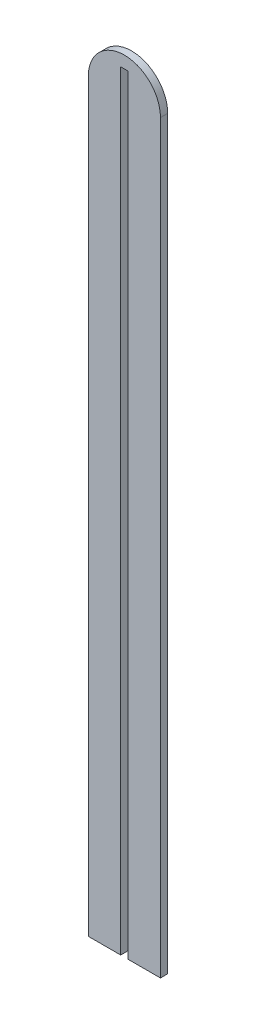
ISO-10303-21;
HEADER;
FILE_DESCRIPTION(('STEP AP214'),'2;1');
FILE_NAME('part.step','',(''),(''),'','','');
FILE_SCHEMA(('AUTOMOTIVE_DESIGN { 1 0 10303 214 1 1 1 1 }'));
ENDSEC;
DATA;
#1=APPLICATION_CONTEXT('core data for automotive mechanical design processes');
#2=APPLICATION_PROTOCOL_DEFINITION('international standard','automotive_design',2000,#1);
#3=PRODUCT_CONTEXT('',#1,'mechanical');
#4=PRODUCT('Part','Part','',(#3));
#5=PRODUCT_RELATED_PRODUCT_CATEGORY('part','',(#4));
#6=PRODUCT_DEFINITION_FORMATION('','',#4);
#7=PRODUCT_DEFINITION_CONTEXT('part definition',#1,'design');
#8=PRODUCT_DEFINITION('design','',#6,#7);
#9=PRODUCT_DEFINITION_SHAPE('','',#8);
#10=(LENGTH_UNIT() NAMED_UNIT(*) SI_UNIT(.MILLI.,.METRE.));
#11=(NAMED_UNIT(*) PLANE_ANGLE_UNIT() SI_UNIT($,.RADIAN.));
#12=(NAMED_UNIT(*) SI_UNIT($,.STERADIAN.) SOLID_ANGLE_UNIT());
#13=UNCERTAINTY_MEASURE_WITH_UNIT(LENGTH_MEASURE(1.E-05),#10,'distance_accuracy_value','');
#14=(GEOMETRIC_REPRESENTATION_CONTEXT(3) GLOBAL_UNCERTAINTY_ASSIGNED_CONTEXT((#13)) GLOBAL_UNIT_ASSIGNED_CONTEXT((#10,
#11,#12)) REPRESENTATION_CONTEXT('',''));
#15=CARTESIAN_POINT('',(0.,0.,0.));
#16=DIRECTION('',(0.,0.,1.));
#17=DIRECTION('',(1.,0.,0.));
#18=AXIS2_PLACEMENT_3D('',#15,#16,#17);
#19=CARTESIAN_POINT('',(14.9999999015433,0.,1.5));
#20=DIRECTION('',(1.,0.,0.));
#21=DIRECTION('',(0.,0.,-1.));
#22=AXIS2_PLACEMENT_3D('',#19,#20,#21);
#23=PLANE('',#22);
#24=DIRECTION('',(0.,-1.,0.));
#25=VECTOR('',#24,1.);
#26=CARTESIAN_POINT('',(14.9999999015433,0.,-1.5));
#27=LINE('',#26,#25);
#28=CARTESIAN_POINT('',(14.9999999015433,154.999998982614,-1.5));
#29=VERTEX_POINT('',#28);
#30=CARTESIAN_POINT('',(14.9999999015433,-155.000001017386,-1.5));
#31=VERTEX_POINT('',#30);
#32=EDGE_CURVE('E129',#29,#31,#27,.T.);
#33=ORIENTED_EDGE('',*,*,#32,.F.);
#34=DIRECTION('',(0.,0.,-1.));
#35=VECTOR('',#34,1.);
#36=CARTESIAN_POINT('',(14.9999999015433,154.999998982614,1.5));
#37=LINE('',#36,#35);
#38=CARTESIAN_POINT('',(14.9999999015433,154.999998982614,1.5));
#39=VERTEX_POINT('',#38);
#40=EDGE_CURVE('E11',#39,#29,#37,.T.);
#41=ORIENTED_EDGE('',*,*,#40,.F.);
#42=DIRECTION('',(0.,-1.,0.));
#43=VECTOR('',#42,1.);
#44=CARTESIAN_POINT('',(14.9999999015433,0.,1.5));
#45=LINE('',#44,#43);
#46=CARTESIAN_POINT('',(14.9999999015433,-155.000001017386,1.5));
#47=VERTEX_POINT('',#46);
#48=EDGE_CURVE('E176',#39,#47,#45,.T.);
#49=ORIENTED_EDGE('',*,*,#48,.T.);
#50=DIRECTION('',(0.,0.,-1.));
#51=VECTOR('',#50,1.);
#52=CARTESIAN_POINT('',(14.9999999015433,-155.000001017386,1.5));
#53=LINE('',#52,#51);
#54=EDGE_CURVE('E84',#47,#31,#53,.T.);
#55=ORIENTED_EDGE('',*,*,#54,.T.);
#56=EDGE_LOOP('',(#33,#41,#49,#55));
#57=FACE_BOUND('',#56,.T.);
#58=ADVANCED_FACE('F34',(#57),#23,.T.);
#59=CARTESIAN_POINT('',(-9.84567288808691E-08,155.000001017386,1.5));
#60=DIRECTION('',(0.,0.,-1.));
#61=DIRECTION('',(-1.,0.,0.));
#62=AXIS2_PLACEMENT_3D('',#59,#60,#61);
#63=CYLINDRICAL_SURFACE('',#62,15.0000000000001);
#64=CARTESIAN_POINT('',(-9.84567288808691E-08,155.000001017386,-1.5));
#65=DIRECTION('',(0.,0.,1.));
#66=DIRECTION('',(1.,0.,0.));
#67=AXIS2_PLACEMENT_3D('',#64,#65,#66);
#68=CIRCLE('',#67,15.0000000000001);
#69=CARTESIAN_POINT('',(-15.0000000984567,155.000003052157,-1.5));
#70=VERTEX_POINT('',#69);
#71=EDGE_CURVE('E132',#29,#70,#68,.T.);
#72=ORIENTED_EDGE('',*,*,#71,.T.);
#73=DIRECTION('',(0.,0.,-1.));
#74=VECTOR('',#73,1.);
#75=CARTESIAN_POINT('',(-15.0000000984567,155.000003052157,1.5));
#76=LINE('',#75,#74);
#77=CARTESIAN_POINT('',(-15.0000000984567,155.000003052157,1.5));
#78=VERTEX_POINT('',#77);
#79=EDGE_CURVE('E42',#78,#70,#76,.T.);
#80=ORIENTED_EDGE('',*,*,#79,.F.);
#81=CARTESIAN_POINT('',(-9.84567288808691E-08,155.000001017386,1.5));
#82=DIRECTION('',(0.,0.,1.));
#83=DIRECTION('',(1.,0.,0.));
#84=AXIS2_PLACEMENT_3D('',#81,#82,#83);
#85=CIRCLE('',#84,15.0000000000001);
#86=EDGE_CURVE('E174',#39,#78,#85,.T.);
#87=ORIENTED_EDGE('',*,*,#86,.F.);
#88=ORIENTED_EDGE('',*,*,#40,.T.);
#89=EDGE_LOOP('',(#72,#80,#87,#88));
#90=FACE_BOUND('',#89,.T.);
#91=ADVANCED_FACE('F179',(#90),#63,.T.);
#92=CARTESIAN_POINT('',(-15.0000000984567,0.,1.5));
#93=DIRECTION('',(1.,0.,0.));
#94=DIRECTION('',(0.,1.,0.));
#95=AXIS2_PLACEMENT_3D('',#92,#93,#94);
#96=PLANE('',#95);
#97=DIRECTION('',(0.,-1.,0.));
#98=VECTOR('',#97,1.);
#99=CARTESIAN_POINT('',(-15.0000000984567,0.,-1.5));
#100=LINE('',#99,#98);
#101=CARTESIAN_POINT('',(-15.0000000984567,-155.000001017386,-1.5));
#102=VERTEX_POINT('',#101);
#103=EDGE_CURVE('E134',#70,#102,#100,.T.);
#104=ORIENTED_EDGE('',*,*,#103,.T.);
#105=DIRECTION('',(0.,0.,-1.));
#106=VECTOR('',#105,1.);
#107=CARTESIAN_POINT('',(-15.0000000984567,-155.000001017386,1.5));
#108=LINE('',#107,#106);
#109=CARTESIAN_POINT('',(-15.0000000984567,-155.000001017386,1.5));
#110=VERTEX_POINT('',#109);
#111=EDGE_CURVE('E150',#110,#102,#108,.T.);
#112=ORIENTED_EDGE('',*,*,#111,.F.);
#113=DIRECTION('',(0.,-1.,0.));
#114=VECTOR('',#113,1.);
#115=CARTESIAN_POINT('',(-15.0000000984567,0.,1.5));
#116=LINE('',#115,#114);
#117=EDGE_CURVE('E159',#78,#110,#116,.T.);
#118=ORIENTED_EDGE('',*,*,#117,.F.);
#119=ORIENTED_EDGE('',*,*,#79,.T.);
#120=EDGE_LOOP('',(#104,#112,#118,#119));
#121=FACE_BOUND('',#120,.T.);
#122=ADVANCED_FACE('F157',(#121),#96,.F.);
#123=CARTESIAN_POINT('',(0.,-155.000001017386,1.5));
#124=DIRECTION('',(0.,1.,0.));
#125=DIRECTION('',(0.,0.,1.));
#126=AXIS2_PLACEMENT_3D('',#123,#124,#125);
#127=PLANE('',#126);
#128=DIRECTION('',(1.,0.,0.));
#129=VECTOR('',#128,1.);
#130=CARTESIAN_POINT('',(0.,-155.000001017386,-1.5));
#131=LINE('',#130,#129);
#132=CARTESIAN_POINT('',(-1.55000009845669,-155.000001017386,-1.5));
#133=VERTEX_POINT('',#132);
#134=EDGE_CURVE('E136',#102,#133,#131,.T.);
#135=ORIENTED_EDGE('',*,*,#134,.T.);
#136=DIRECTION('',(0.,0.,-1.));
#137=VECTOR('',#136,1.);
#138=CARTESIAN_POINT('',(-1.55000009845669,-155.000001017386,1.5));
#139=LINE('',#138,#137);
#140=CARTESIAN_POINT('',(-1.55000009845669,-155.000001017386,1.5));
#141=VERTEX_POINT('',#140);
#142=EDGE_CURVE('E147',#141,#133,#139,.T.);
#143=ORIENTED_EDGE('',*,*,#142,.F.);
#144=DIRECTION('',(1.,0.,0.));
#145=VECTOR('',#144,1.);
#146=CARTESIAN_POINT('',(0.,-155.000001017386,1.5));
#147=LINE('',#146,#145);
#148=EDGE_CURVE('E126',#110,#141,#147,.T.);
#149=ORIENTED_EDGE('',*,*,#148,.F.);
#150=ORIENTED_EDGE('',*,*,#111,.T.);
#151=EDGE_LOOP('',(#135,#143,#149,#150));
#152=FACE_BOUND('',#151,.T.);
#153=ADVANCED_FACE('F168',(#152),#127,.F.);
#154=CARTESIAN_POINT('',(-1.55000009845669,0.,1.5));
#155=DIRECTION('',(-1.,0.,0.));
#156=DIRECTION('',(0.,0.,1.));
#157=AXIS2_PLACEMENT_3D('',#154,#155,#156);
#158=PLANE('',#157);
#159=DIRECTION('',(0.,1.,0.));
#160=VECTOR('',#159,1.);
#161=CARTESIAN_POINT('',(-1.55000009845669,0.,-1.5));
#162=LINE('',#161,#160);
#163=CARTESIAN_POINT('',(-1.55000009845669,164.999998982614,-1.5));
#164=VERTEX_POINT('',#163);
#165=EDGE_CURVE('E138',#133,#164,#162,.T.);
#166=ORIENTED_EDGE('',*,*,#165,.T.);
#167=DIRECTION('',(0.,0.,-1.));
#168=VECTOR('',#167,1.);
#169=CARTESIAN_POINT('',(-1.55000009845669,164.999998982614,1.5));
#170=LINE('',#169,#168);
#171=CARTESIAN_POINT('',(-1.55000009845669,164.999998982614,1.5));
#172=VERTEX_POINT('',#171);
#173=EDGE_CURVE('E121',#172,#164,#170,.T.);
#174=ORIENTED_EDGE('',*,*,#173,.F.);
#175=DIRECTION('',(0.,1.,0.));
#176=VECTOR('',#175,1.);
#177=CARTESIAN_POINT('',(-1.55000009845669,0.,1.5));
#178=LINE('',#177,#176);
#179=EDGE_CURVE('E108',#141,#172,#178,.T.);
#180=ORIENTED_EDGE('',*,*,#179,.F.);
#181=ORIENTED_EDGE('',*,*,#142,.T.);
#182=EDGE_LOOP('',(#166,#174,#180,#181));
#183=FACE_BOUND('',#182,.T.);
#184=ADVANCED_FACE('F171',(#183),#158,.F.);
#185=CARTESIAN_POINT('',(0.,164.999998982614,1.5));
#186=DIRECTION('',(0.,1.,0.));
#187=DIRECTION('',(0.,0.,1.));
#188=AXIS2_PLACEMENT_3D('',#185,#186,#187);
#189=PLANE('',#188);
#190=DIRECTION('',(1.,0.,0.));
#191=VECTOR('',#190,1.);
#192=CARTESIAN_POINT('',(0.,164.999998982614,-1.5));
#193=LINE('',#192,#191);
#194=CARTESIAN_POINT('',(1.54999990154331,164.999998982614,-1.5));
#195=VERTEX_POINT('',#194);
#196=EDGE_CURVE('E117',#164,#195,#193,.T.);
#197=ORIENTED_EDGE('',*,*,#196,.T.);
#198=DIRECTION('',(0.,0.,-1.));
#199=VECTOR('',#198,1.);
#200=CARTESIAN_POINT('',(1.54999990154331,164.999998982614,1.5));
#201=LINE('',#200,#199);
#202=CARTESIAN_POINT('',(1.54999990154331,164.999998982614,1.5));
#203=VERTEX_POINT('',#202);
#204=EDGE_CURVE('E114',#203,#195,#201,.T.);
#205=ORIENTED_EDGE('',*,*,#204,.F.);
#206=DIRECTION('',(1.,0.,0.));
#207=VECTOR('',#206,1.);
#208=CARTESIAN_POINT('',(0.,164.999998982614,1.5));
#209=LINE('',#208,#207);
#210=EDGE_CURVE('E102',#172,#203,#209,.T.);
#211=ORIENTED_EDGE('',*,*,#210,.F.);
#212=ORIENTED_EDGE('',*,*,#173,.T.);
#213=EDGE_LOOP('',(#197,#205,#211,#212));
#214=FACE_BOUND('',#213,.T.);
#215=ADVANCED_FACE('F115',(#214),#189,.F.);
#216=CARTESIAN_POINT('',(1.54999990154331,0.,1.5));
#217=DIRECTION('',(-1.,0.,0.));
#218=DIRECTION('',(0.,0.,1.));
#219=AXIS2_PLACEMENT_3D('',#216,#217,#218);
#220=PLANE('',#219);
#221=DIRECTION('',(0.,1.,0.));
#222=VECTOR('',#221,1.);
#223=CARTESIAN_POINT('',(1.54999990154331,0.,-1.5));
#224=LINE('',#223,#222);
#225=CARTESIAN_POINT('',(1.54999990154331,-155.000001017386,-1.5));
#226=VERTEX_POINT('',#225);
#227=EDGE_CURVE('E142',#226,#195,#224,.T.);
#228=ORIENTED_EDGE('',*,*,#227,.F.);
#229=DIRECTION('',(0.,0.,-1.));
#230=VECTOR('',#229,1.);
#231=CARTESIAN_POINT('',(1.54999990154331,-155.000001017386,1.5));
#232=LINE('',#231,#230);
#233=CARTESIAN_POINT('',(1.54999990154331,-155.000001017386,1.5));
#234=VERTEX_POINT('',#233);
#235=EDGE_CURVE('E77',#234,#226,#232,.T.);
#236=ORIENTED_EDGE('',*,*,#235,.F.);
#237=DIRECTION('',(0.,1.,0.));
#238=VECTOR('',#237,1.);
#239=CARTESIAN_POINT('',(1.54999990154331,0.,1.5));
#240=LINE('',#239,#238);
#241=EDGE_CURVE('E106',#234,#203,#240,.T.);
#242=ORIENTED_EDGE('',*,*,#241,.T.);
#243=ORIENTED_EDGE('',*,*,#204,.T.);
#244=EDGE_LOOP('',(#228,#236,#242,#243));
#245=FACE_BOUND('',#244,.T.);
#246=ADVANCED_FACE('F123',(#245),#220,.T.);
#247=EDGE_CURVE('E139',#226,#31,#131,.T.);
#248=ORIENTED_EDGE('',*,*,#247,.T.);
#249=ORIENTED_EDGE('',*,*,#54,.F.);
#250=EDGE_CURVE('E50',#234,#47,#147,.T.);
#251=ORIENTED_EDGE('',*,*,#250,.F.);
#252=ORIENTED_EDGE('',*,*,#235,.T.);
#253=EDGE_LOOP('',(#248,#249,#251,#252));
#254=FACE_BOUND('',#253,.T.);
#255=ADVANCED_FACE('F177',(#254),#127,.F.);
#256=CARTESIAN_POINT('',(0.,0.,1.5));
#257=DIRECTION('',(0.,0.,1.));
#258=DIRECTION('',(1.,0.,0.));
#259=AXIS2_PLACEMENT_3D('',#256,#257,#258);
#260=PLANE('',#259);
#261=ORIENTED_EDGE('',*,*,#48,.F.);
#262=ORIENTED_EDGE('',*,*,#86,.T.);
#263=ORIENTED_EDGE('',*,*,#117,.T.);
#264=ORIENTED_EDGE('',*,*,#148,.T.);
#265=ORIENTED_EDGE('',*,*,#179,.T.);
#266=ORIENTED_EDGE('',*,*,#210,.T.);
#267=ORIENTED_EDGE('',*,*,#241,.F.);
#268=ORIENTED_EDGE('',*,*,#250,.T.);
#269=EDGE_LOOP('',(#261,#262,#263,#264,#265,#266,#267,#268));
#270=FACE_BOUND('',#269,.T.);
#271=ADVANCED_FACE('F104',(#270),#260,.T.);
#272=CARTESIAN_POINT('',(0.,0.,-1.5));
#273=DIRECTION('',(0.,0.,1.));
#274=DIRECTION('',(1.,0.,0.));
#275=AXIS2_PLACEMENT_3D('',#272,#273,#274);
#276=PLANE('',#275);
#277=ORIENTED_EDGE('',*,*,#32,.T.);
#278=ORIENTED_EDGE('',*,*,#247,.F.);
#279=ORIENTED_EDGE('',*,*,#227,.T.);
#280=ORIENTED_EDGE('',*,*,#196,.F.);
#281=ORIENTED_EDGE('',*,*,#165,.F.);
#282=ORIENTED_EDGE('',*,*,#134,.F.);
#283=ORIENTED_EDGE('',*,*,#103,.F.);
#284=ORIENTED_EDGE('',*,*,#71,.F.);
#285=EDGE_LOOP('',(#277,#278,#279,#280,#281,#282,#283,#284));
#286=FACE_BOUND('',#285,.T.);
#287=ADVANCED_FACE('F164',(#286),#276,.F.);
#288=CLOSED_SHELL('',(#58,#91,#122,#153,#184,#215,#246,#255,#271,#287));
#289=MANIFOLD_SOLID_BREP('B2',#288);
#290=ADVANCED_BREP_SHAPE_REPRESENTATION('',(#18,#289),#14);
#291=SHAPE_DEFINITION_REPRESENTATION(#9,#290);
ENDSEC;
END-ISO-10303-21;
